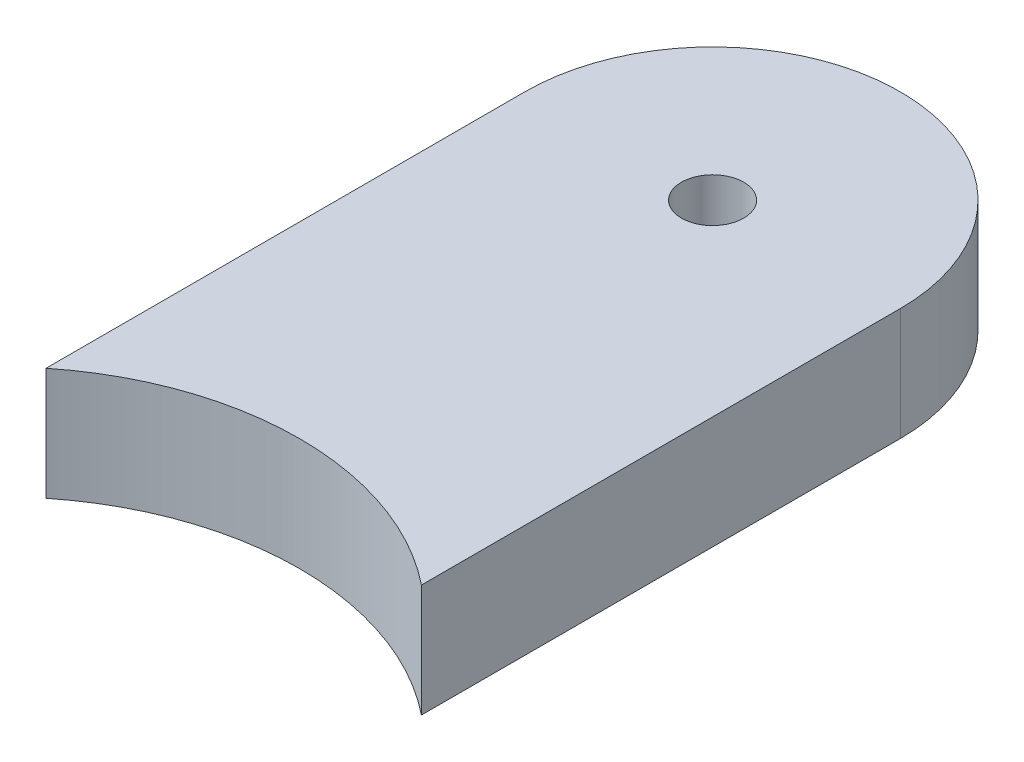
ISO-10303-21;
HEADER;
FILE_DESCRIPTION(('STEP AP214'),'2;1');
FILE_NAME('part.step','',(''),(''),'','','');
FILE_SCHEMA(('AUTOMOTIVE_DESIGN { 1 0 10303 214 1 1 1 1 }'));
ENDSEC;
DATA;
#1=APPLICATION_CONTEXT('core data for automotive mechanical design processes');
#2=APPLICATION_PROTOCOL_DEFINITION('international standard','automotive_design',2000,#1);
#3=PRODUCT_CONTEXT('',#1,'mechanical');
#4=PRODUCT('Part','Part','',(#3));
#5=PRODUCT_RELATED_PRODUCT_CATEGORY('part','',(#4));
#6=PRODUCT_DEFINITION_FORMATION('','',#4);
#7=PRODUCT_DEFINITION_CONTEXT('part definition',#1,'design');
#8=PRODUCT_DEFINITION('design','',#6,#7);
#9=PRODUCT_DEFINITION_SHAPE('','',#8);
#10=(LENGTH_UNIT() NAMED_UNIT(*) SI_UNIT(.MILLI.,.METRE.));
#11=(NAMED_UNIT(*) PLANE_ANGLE_UNIT() SI_UNIT($,.RADIAN.));
#12=(NAMED_UNIT(*) SI_UNIT($,.STERADIAN.) SOLID_ANGLE_UNIT());
#13=UNCERTAINTY_MEASURE_WITH_UNIT(LENGTH_MEASURE(1.E-05),#10,'distance_accuracy_value','');
#14=(GEOMETRIC_REPRESENTATION_CONTEXT(3) GLOBAL_UNCERTAINTY_ASSIGNED_CONTEXT((#13)) GLOBAL_UNIT_ASSIGNED_CONTEXT((#10,
#11,#12)) REPRESENTATION_CONTEXT('',''));
#15=CARTESIAN_POINT('',(0.,0.,0.));
#16=DIRECTION('',(0.,0.,1.));
#17=DIRECTION('',(1.,0.,0.));
#18=AXIS2_PLACEMENT_3D('',#15,#16,#17);
#19=CARTESIAN_POINT('',(0.,15.,0.));
#20=DIRECTION('',(0.,1.,0.));
#21=DIRECTION('',(0.,0.,1.));
#22=AXIS2_PLACEMENT_3D('',#19,#20,#21);
#23=PLANE('',#22);
#24=CARTESIAN_POINT('',(0.,15.,0.));
#25=DIRECTION('',(0.,-1.,0.));
#26=DIRECTION('',(0.,0.,1.));
#27=AXIS2_PLACEMENT_3D('',#24,#25,#26);
#28=CIRCLE('',#27,40.);
#29=CARTESIAN_POINT('',(-25.,15.,-31.224989991992));
#30=VERTEX_POINT('',#29);
#31=CARTESIAN_POINT('',(25.,15.,-31.224989991992));
#32=VERTEX_POINT('',#31);
#33=EDGE_CURVE('E85',#30,#32,#28,.T.);
#34=ORIENTED_EDGE('',*,*,#33,.T.);
#35=DIRECTION('',(0.,0.,-1.));
#36=VECTOR('',#35,1.);
#37=CARTESIAN_POINT('',(25.,15.,-31.224989991992));
#38=LINE('',#37,#36);
#39=CARTESIAN_POINT('',(25.,15.,-95.));
#40=VERTEX_POINT('',#39);
#41=EDGE_CURVE('E80',#32,#40,#38,.T.);
#42=ORIENTED_EDGE('',*,*,#41,.T.);
#43=CARTESIAN_POINT('',(0.,15.,-95.));
#44=DIRECTION('',(0.,1.,0.));
#45=DIRECTION('',(0.,0.,-1.));
#46=AXIS2_PLACEMENT_3D('',#43,#44,#45);
#47=CIRCLE('',#46,25.);
#48=CARTESIAN_POINT('',(-25.,15.,-95.));
#49=VERTEX_POINT('',#48);
#50=EDGE_CURVE('E83',#40,#49,#47,.T.);
#51=ORIENTED_EDGE('',*,*,#50,.T.);
#52=DIRECTION('',(0.,0.,1.));
#53=VECTOR('',#52,1.);
#54=CARTESIAN_POINT('',(-25.,15.,-31.224989991992));
#55=LINE('',#54,#53);
#56=EDGE_CURVE('E50',#49,#30,#55,.T.);
#57=ORIENTED_EDGE('',*,*,#56,.T.);
#58=EDGE_LOOP('',(#34,#42,#51,#57));
#59=FACE_BOUND('',#58,.T.);
#60=CARTESIAN_POINT('',(0.,15.,-95.));
#61=DIRECTION('',(0.,1.,0.));
#62=DIRECTION('',(0.,0.,1.));
#63=AXIS2_PLACEMENT_3D('',#60,#61,#62);
#64=CIRCLE('',#63,4.15);
#65=CARTESIAN_POINT('',(0.,15.,-90.85));
#66=VERTEX_POINT('',#65);
#67=EDGE_CURVE('E100',#66,#66,#64,.T.);
#68=ORIENTED_EDGE('',*,*,#67,.F.);
#69=EDGE_LOOP('',(#68));
#70=FACE_BOUND('',#69,.T.);
#71=ADVANCED_FACE('F33',(#59,#70),#23,.T.);
#72=CARTESIAN_POINT('',(0.,0.,0.));
#73=DIRECTION('',(0.,1.,0.));
#74=DIRECTION('',(0.,0.,1.));
#75=AXIS2_PLACEMENT_3D('',#72,#73,#74);
#76=PLANE('',#75);
#77=CARTESIAN_POINT('',(0.,0.,0.));
#78=DIRECTION('',(0.,-1.,0.));
#79=DIRECTION('',(0.,0.,1.));
#80=AXIS2_PLACEMENT_3D('',#77,#78,#79);
#81=CIRCLE('',#80,40.);
#82=CARTESIAN_POINT('',(-25.,0.,-31.224989991992));
#83=VERTEX_POINT('',#82);
#84=CARTESIAN_POINT('',(25.,0.,-31.224989991992));
#85=VERTEX_POINT('',#84);
#86=EDGE_CURVE('E97',#83,#85,#81,.T.);
#87=ORIENTED_EDGE('',*,*,#86,.F.);
#88=DIRECTION('',(0.,0.,1.));
#89=VECTOR('',#88,1.);
#90=CARTESIAN_POINT('',(-25.,0.,-31.224989991992));
#91=LINE('',#90,#89);
#92=CARTESIAN_POINT('',(-25.,0.,-95.));
#93=VERTEX_POINT('',#92);
#94=EDGE_CURVE('E73',#93,#83,#91,.T.);
#95=ORIENTED_EDGE('',*,*,#94,.F.);
#96=CARTESIAN_POINT('',(0.,0.,-95.));
#97=DIRECTION('',(0.,1.,0.));
#98=DIRECTION('',(0.,0.,-1.));
#99=AXIS2_PLACEMENT_3D('',#96,#97,#98);
#100=CIRCLE('',#99,25.);
#101=CARTESIAN_POINT('',(25.,0.,-95.));
#102=VERTEX_POINT('',#101);
#103=EDGE_CURVE('E67',#102,#93,#100,.T.);
#104=ORIENTED_EDGE('',*,*,#103,.F.);
#105=DIRECTION('',(0.,0.,-1.));
#106=VECTOR('',#105,1.);
#107=CARTESIAN_POINT('',(25.,0.,-31.224989991992));
#108=LINE('',#107,#106);
#109=EDGE_CURVE('E89',#85,#102,#108,.T.);
#110=ORIENTED_EDGE('',*,*,#109,.F.);
#111=EDGE_LOOP('',(#87,#95,#104,#110));
#112=FACE_BOUND('',#111,.T.);
#113=CARTESIAN_POINT('',(0.,0.,-95.));
#114=DIRECTION('',(0.,1.,0.));
#115=DIRECTION('',(0.,0.,1.));
#116=AXIS2_PLACEMENT_3D('',#113,#114,#115);
#117=CIRCLE('',#116,4.15);
#118=CARTESIAN_POINT('',(0.,0.,-90.85));
#119=VERTEX_POINT('',#118);
#120=EDGE_CURVE('E112',#119,#119,#117,.T.);
#121=ORIENTED_EDGE('',*,*,#120,.T.);
#122=EDGE_LOOP('',(#121));
#123=FACE_BOUND('',#122,.T.);
#124=ADVANCED_FACE('F108',(#112,#123),#76,.F.);
#125=CARTESIAN_POINT('',(0.,15.,0.));
#126=DIRECTION('',(0.,-1.,0.));
#127=DIRECTION('',(0.,0.,-1.));
#128=AXIS2_PLACEMENT_3D('',#125,#126,#127);
#129=CYLINDRICAL_SURFACE('',#128,40.);
#130=ORIENTED_EDGE('',*,*,#86,.T.);
#131=DIRECTION('',(0.,-1.,0.));
#132=VECTOR('',#131,1.);
#133=CARTESIAN_POINT('',(25.,15.,-31.224989991992));
#134=LINE('',#133,#132);
#135=EDGE_CURVE('E11',#32,#85,#134,.T.);
#136=ORIENTED_EDGE('',*,*,#135,.F.);
#137=ORIENTED_EDGE('',*,*,#33,.F.);
#138=DIRECTION('',(0.,-1.,0.));
#139=VECTOR('',#138,1.);
#140=CARTESIAN_POINT('',(-25.,15.,-31.224989991992));
#141=LINE('',#140,#139);
#142=EDGE_CURVE('E93',#30,#83,#141,.T.);
#143=ORIENTED_EDGE('',*,*,#142,.T.);
#144=EDGE_LOOP('',(#130,#136,#137,#143));
#145=FACE_BOUND('',#144,.T.);
#146=ADVANCED_FACE('F35',(#145),#129,.F.);
#147=CARTESIAN_POINT('',(25.,15.,-31.224989991992));
#148=DIRECTION('',(-1.,0.,0.));
#149=DIRECTION('',(0.,0.,1.));
#150=AXIS2_PLACEMENT_3D('',#147,#148,#149);
#151=PLANE('',#150);
#152=ORIENTED_EDGE('',*,*,#109,.T.);
#153=DIRECTION('',(0.,-1.,0.));
#154=VECTOR('',#153,1.);
#155=CARTESIAN_POINT('',(25.,15.,-95.));
#156=LINE('',#155,#154);
#157=EDGE_CURVE('E42',#40,#102,#156,.T.);
#158=ORIENTED_EDGE('',*,*,#157,.F.);
#159=ORIENTED_EDGE('',*,*,#41,.F.);
#160=ORIENTED_EDGE('',*,*,#135,.T.);
#161=EDGE_LOOP('',(#152,#158,#159,#160));
#162=FACE_BOUND('',#161,.T.);
#163=ADVANCED_FACE('F88',(#162),#151,.F.);
#164=CARTESIAN_POINT('',(0.,15.,-95.));
#165=DIRECTION('',(0.,-1.,0.));
#166=DIRECTION('',(0.,0.,-1.));
#167=AXIS2_PLACEMENT_3D('',#164,#165,#166);
#168=CYLINDRICAL_SURFACE('',#167,25.);
#169=ORIENTED_EDGE('',*,*,#103,.T.);
#170=DIRECTION('',(0.,-1.,0.));
#171=VECTOR('',#170,1.);
#172=CARTESIAN_POINT('',(-25.,15.,-95.));
#173=LINE('',#172,#171);
#174=EDGE_CURVE('E90',#49,#93,#173,.T.);
#175=ORIENTED_EDGE('',*,*,#174,.F.);
#176=ORIENTED_EDGE('',*,*,#50,.F.);
#177=ORIENTED_EDGE('',*,*,#157,.T.);
#178=EDGE_LOOP('',(#169,#175,#176,#177));
#179=FACE_BOUND('',#178,.T.);
#180=ADVANCED_FACE('F91',(#179),#168,.T.);
#181=CARTESIAN_POINT('',(-25.,15.,-31.224989991992));
#182=DIRECTION('',(1.,0.,0.));
#183=DIRECTION('',(0.,0.,-1.));
#184=AXIS2_PLACEMENT_3D('',#181,#182,#183);
#185=PLANE('',#184);
#186=ORIENTED_EDGE('',*,*,#94,.T.);
#187=ORIENTED_EDGE('',*,*,#142,.F.);
#188=ORIENTED_EDGE('',*,*,#56,.F.);
#189=ORIENTED_EDGE('',*,*,#174,.T.);
#190=EDGE_LOOP('',(#186,#187,#188,#189));
#191=FACE_BOUND('',#190,.T.);
#192=ADVANCED_FACE('F105',(#191),#185,.F.);
#193=CARTESIAN_POINT('',(0.,15.,-95.));
#194=DIRECTION('',(0.,-1.,0.));
#195=DIRECTION('',(0.,0.,-1.));
#196=AXIS2_PLACEMENT_3D('',#193,#194,#195);
#197=CYLINDRICAL_SURFACE('',#196,4.15);
#198=ORIENTED_EDGE('',*,*,#67,.T.);
#199=EDGE_LOOP('',(#198));
#200=FACE_BOUND('',#199,.T.);
#201=ORIENTED_EDGE('',*,*,#120,.F.);
#202=EDGE_LOOP('',(#201));
#203=FACE_BOUND('',#202,.T.);
#204=ADVANCED_FACE('F118',(#200,#203),#197,.F.);
#205=CLOSED_SHELL('',(#71,#124,#146,#163,#180,#192,#204));
#206=MANIFOLD_SOLID_BREP('B2',#205);
#207=ADVANCED_BREP_SHAPE_REPRESENTATION('',(#18,#206),#14);
#208=SHAPE_DEFINITION_REPRESENTATION(#9,#207);
ENDSEC;
END-ISO-10303-21;
